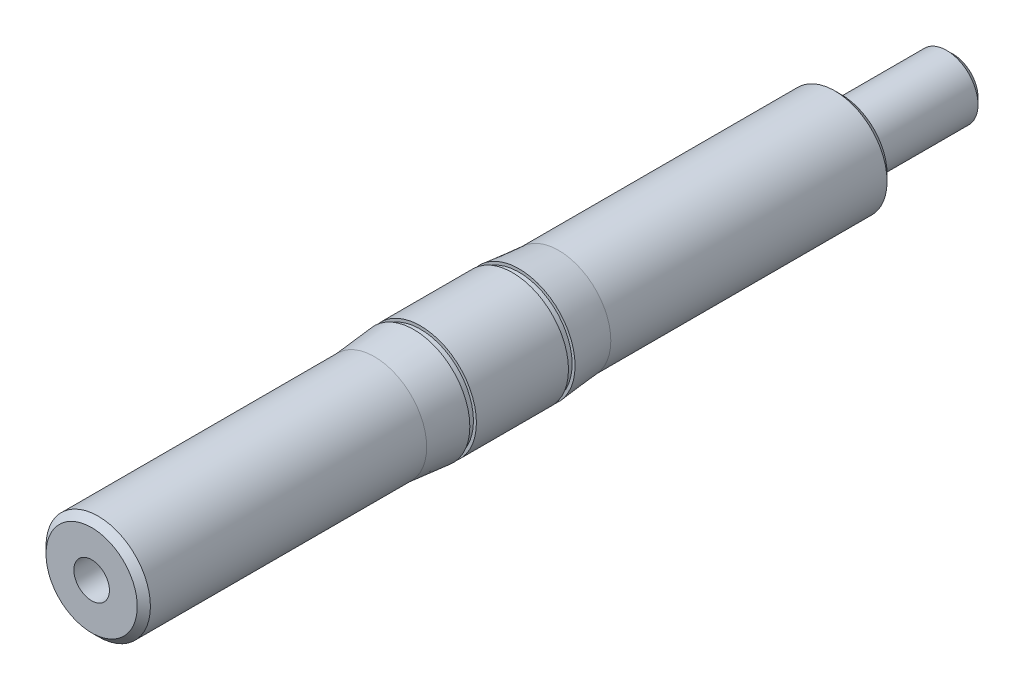
ISO-10303-21;
HEADER;
FILE_DESCRIPTION(('STEP AP214'),'2;1');
FILE_NAME('part.step','',(''),(''),'','','');
FILE_SCHEMA(('AUTOMOTIVE_DESIGN { 1 0 10303 214 1 1 1 1 }'));
ENDSEC;
DATA;
#1=APPLICATION_CONTEXT('core data for automotive mechanical design processes');
#2=APPLICATION_PROTOCOL_DEFINITION('international standard','automotive_design',2000,#1);
#3=PRODUCT_CONTEXT('',#1,'mechanical');
#4=PRODUCT('Part','Part','',(#3));
#5=PRODUCT_RELATED_PRODUCT_CATEGORY('part','',(#4));
#6=PRODUCT_DEFINITION_FORMATION('','',#4);
#7=PRODUCT_DEFINITION_CONTEXT('part definition',#1,'design');
#8=PRODUCT_DEFINITION('design','',#6,#7);
#9=PRODUCT_DEFINITION_SHAPE('','',#8);
#10=(LENGTH_UNIT() NAMED_UNIT(*) SI_UNIT(.MILLI.,.METRE.));
#11=(NAMED_UNIT(*) PLANE_ANGLE_UNIT() SI_UNIT($,.RADIAN.));
#12=(NAMED_UNIT(*) SI_UNIT($,.STERADIAN.) SOLID_ANGLE_UNIT());
#13=UNCERTAINTY_MEASURE_WITH_UNIT(LENGTH_MEASURE(1.E-05),#10,'distance_accuracy_value','');
#14=(GEOMETRIC_REPRESENTATION_CONTEXT(3) GLOBAL_UNCERTAINTY_ASSIGNED_CONTEXT((#13)) GLOBAL_UNIT_ASSIGNED_CONTEXT((#10,
#11,#12)) REPRESENTATION_CONTEXT('',''));
#15=CARTESIAN_POINT('',(0.,0.,0.));
#16=DIRECTION('',(0.,0.,1.));
#17=DIRECTION('',(1.,0.,0.));
#18=AXIS2_PLACEMENT_3D('',#15,#16,#17);
#19=CARTESIAN_POINT('',(0.,0.,83.8048447877854));
#20=DIRECTION('',(0.,0.,1.));
#21=DIRECTION('',(1.,0.,0.));
#22=AXIS2_PLACEMENT_3D('',#19,#20,#21);
#23=CYLINDRICAL_SURFACE('',#22,7.9375);
#24=CARTESIAN_POINT('',(0.,0.,-56.));
#25=DIRECTION('',(0.,0.,1.));
#26=DIRECTION('',(1.,0.,0.));
#27=AXIS2_PLACEMENT_3D('',#24,#25,#26);
#28=CIRCLE('',#27,7.9375);
#29=CARTESIAN_POINT('',(7.9375,0.,-56.));
#30=VERTEX_POINT('',#29);
#31=EDGE_CURVE('E175',#30,#30,#28,.T.);
#32=ORIENTED_EDGE('',*,*,#31,.T.);
#33=EDGE_LOOP('',(#32));
#34=FACE_BOUND('',#33,.T.);
#35=CARTESIAN_POINT('',(0.,0.,-14.));
#36=DIRECTION('',(0.,0.,1.));
#37=DIRECTION('',(1.,0.,0.));
#38=AXIS2_PLACEMENT_3D('',#35,#36,#37);
#39=CIRCLE('',#38,7.9375);
#40=CARTESIAN_POINT('',(7.9375,0.,-14.));
#41=VERTEX_POINT('',#40);
#42=EDGE_CURVE('E135',#41,#41,#39,.T.);
#43=ORIENTED_EDGE('',*,*,#42,.F.);
#44=EDGE_LOOP('',(#43));
#45=FACE_BOUND('',#44,.T.);
#46=ADVANCED_FACE('F112',(#34,#45),#23,.T.);
#47=CARTESIAN_POINT('',(0.,7.9375,-57.));
#48=DIRECTION('',(0.,0.,1.));
#49=DIRECTION('',(1.,0.,0.));
#50=AXIS2_PLACEMENT_3D('',#47,#48,#49);
#51=PLANE('',#50);
#52=CARTESIAN_POINT('',(0.,0.,-57.));
#53=DIRECTION('',(0.,0.,1.));
#54=DIRECTION('',(1.,0.,0.));
#55=AXIS2_PLACEMENT_3D('',#52,#53,#54);
#56=CIRCLE('',#55,4.7625);
#57=CARTESIAN_POINT('',(4.7625,0.,-57.));
#58=VERTEX_POINT('',#57);
#59=EDGE_CURVE('E131',#58,#58,#56,.T.);
#60=ORIENTED_EDGE('',*,*,#59,.T.);
#61=EDGE_LOOP('',(#60));
#62=FACE_BOUND('',#61,.T.);
#63=CARTESIAN_POINT('',(0.,0.,-57.));
#64=DIRECTION('',(0.,0.,1.));
#65=DIRECTION('',(1.,0.,0.));
#66=AXIS2_PLACEMENT_3D('',#63,#64,#65);
#67=CIRCLE('',#66,6.93749999999996);
#68=CARTESIAN_POINT('',(6.93749999999996,0.,-57.));
#69=VERTEX_POINT('',#68);
#70=EDGE_CURVE('E178',#69,#69,#67,.F.);
#71=ORIENTED_EDGE('',*,*,#70,.T.);
#72=EDGE_LOOP('',(#71));
#73=FACE_BOUND('',#72,.T.);
#74=ADVANCED_FACE('F196',(#62,#73),#51,.F.);
#75=CARTESIAN_POINT('',(0.,7.9375,57.));
#76=DIRECTION('',(0.,0.,-1.));
#77=DIRECTION('',(-1.,0.,0.));
#78=AXIS2_PLACEMENT_3D('',#75,#76,#77);
#79=PLANE('',#78);
#80=CARTESIAN_POINT('',(0.,0.,57.));
#81=DIRECTION('',(0.,0.,1.));
#82=DIRECTION('',(1.,0.,0.));
#83=AXIS2_PLACEMENT_3D('',#80,#81,#82);
#84=CIRCLE('',#83,2.7051);
#85=CARTESIAN_POINT('',(2.7051,0.,57.));
#86=VERTEX_POINT('',#85);
#87=EDGE_CURVE('E132',#86,#86,#84,.T.);
#88=ORIENTED_EDGE('',*,*,#87,.F.);
#89=EDGE_LOOP('',(#88));
#90=FACE_BOUND('',#89,.T.);
#91=CARTESIAN_POINT('',(0.,0.,57.));
#92=DIRECTION('',(0.,0.,-1.));
#93=DIRECTION('',(-1.,0.,0.));
#94=AXIS2_PLACEMENT_3D('',#91,#92,#93);
#95=CIRCLE('',#94,6.93750000000001);
#96=CARTESIAN_POINT('',(-6.93750000000001,0.,57.));
#97=VERTEX_POINT('',#96);
#98=EDGE_CURVE('E169',#97,#97,#95,.F.);
#99=ORIENTED_EDGE('',*,*,#98,.T.);
#100=EDGE_LOOP('',(#99));
#101=FACE_BOUND('',#100,.T.);
#102=ADVANCED_FACE('F202',(#90,#101),#79,.F.);
#103=CARTESIAN_POINT('',(0.,0.,83.8048447877854));
#104=DIRECTION('',(0.,0.,1.));
#105=DIRECTION('',(1.,0.,0.));
#106=AXIS2_PLACEMENT_3D('',#103,#104,#105);
#107=CYLINDRICAL_SURFACE('',#106,7.9375);
#108=CARTESIAN_POINT('',(0.,0.,56.));
#109=DIRECTION('',(0.,0.,-1.));
#110=DIRECTION('',(-1.,0.,0.));
#111=AXIS2_PLACEMENT_3D('',#108,#109,#110);
#112=CIRCLE('',#111,7.9375);
#113=CARTESIAN_POINT('',(-7.9375,0.,56.));
#114=VERTEX_POINT('',#113);
#115=EDGE_CURVE('E172',#114,#114,#112,.T.);
#116=ORIENTED_EDGE('',*,*,#115,.T.);
#117=EDGE_LOOP('',(#116));
#118=FACE_BOUND('',#117,.T.);
#119=CARTESIAN_POINT('',(0.,0.,14.));
#120=DIRECTION('',(0.,0.,1.));
#121=DIRECTION('',(1.,0.,0.));
#122=AXIS2_PLACEMENT_3D('',#119,#120,#121);
#123=CIRCLE('',#122,7.9375);
#124=CARTESIAN_POINT('',(7.9375,0.,14.));
#125=VERTEX_POINT('',#124);
#126=EDGE_CURVE('E166',#125,#125,#123,.T.);
#127=ORIENTED_EDGE('',*,*,#126,.T.);
#128=EDGE_LOOP('',(#127));
#129=FACE_BOUND('',#128,.T.);
#130=ADVANCED_FACE('F260',(#118,#129),#107,.T.);
#131=CARTESIAN_POINT('',(0.,0.,8.00000000000001));
#132=DIRECTION('',(0.,0.,-1.));
#133=DIRECTION('',(-1.,0.,0.));
#134=AXIS2_PLACEMENT_3D('',#131,#132,#133);
#135=CONICAL_SURFACE('',#134,8.5,0.0934767811585897);
#136=ORIENTED_EDGE('',*,*,#126,.F.);
#137=EDGE_LOOP('',(#136));
#138=FACE_BOUND('',#137,.T.);
#139=CARTESIAN_POINT('',(0.,0.,8.00000000000001));
#140=DIRECTION('',(0.,0.,1.));
#141=DIRECTION('',(1.,0.,0.));
#142=AXIS2_PLACEMENT_3D('',#139,#140,#141);
#143=CIRCLE('',#142,8.5);
#144=CARTESIAN_POINT('',(8.5,0.,8.00000000000001));
#145=VERTEX_POINT('',#144);
#146=EDGE_CURVE('E163',#145,#145,#143,.T.);
#147=ORIENTED_EDGE('',*,*,#146,.T.);
#148=EDGE_LOOP('',(#147));
#149=FACE_BOUND('',#148,.T.);
#150=ADVANCED_FACE('F256',(#138,#149),#135,.T.);
#151=CARTESIAN_POINT('',(0.,8.05,8.));
#152=DIRECTION('',(0.,0.,1.));
#153=DIRECTION('',(1.,0.,0.));
#154=AXIS2_PLACEMENT_3D('',#151,#152,#153);
#155=PLANE('',#154);
#156=ORIENTED_EDGE('',*,*,#146,.F.);
#157=EDGE_LOOP('',(#156));
#158=FACE_BOUND('',#157,.T.);
#159=CARTESIAN_POINT('',(0.,0.,8.00000000000001));
#160=DIRECTION('',(0.,0.,1.));
#161=DIRECTION('',(1.,0.,0.));
#162=AXIS2_PLACEMENT_3D('',#159,#160,#161);
#163=CIRCLE('',#162,8.05);
#164=CARTESIAN_POINT('',(8.05,0.,8.00000000000001));
#165=VERTEX_POINT('',#164);
#166=EDGE_CURVE('E160',#165,#165,#163,.T.);
#167=ORIENTED_EDGE('',*,*,#166,.T.);
#168=EDGE_LOOP('',(#167));
#169=FACE_BOUND('',#168,.T.);
#170=ADVANCED_FACE('F252',(#158,#169),#155,.F.);
#171=CARTESIAN_POINT('',(0.,0.,83.8048447877854));
#172=DIRECTION('',(0.,0.,1.));
#173=DIRECTION('',(1.,0.,0.));
#174=AXIS2_PLACEMENT_3D('',#171,#172,#173);
#175=CYLINDRICAL_SURFACE('',#174,8.05);
#176=ORIENTED_EDGE('',*,*,#166,.F.);
#177=EDGE_LOOP('',(#176));
#178=FACE_BOUND('',#177,.T.);
#179=CARTESIAN_POINT('',(0.,0.,7.00000000000001));
#180=DIRECTION('',(0.,0.,1.));
#181=DIRECTION('',(1.,0.,0.));
#182=AXIS2_PLACEMENT_3D('',#179,#180,#181);
#183=CIRCLE('',#182,8.05);
#184=CARTESIAN_POINT('',(8.05,0.,7.00000000000001));
#185=VERTEX_POINT('',#184);
#186=EDGE_CURVE('E157',#185,#185,#183,.T.);
#187=ORIENTED_EDGE('',*,*,#186,.T.);
#188=EDGE_LOOP('',(#187));
#189=FACE_BOUND('',#188,.T.);
#190=ADVANCED_FACE('F248',(#178,#189),#175,.T.);
#191=CARTESIAN_POINT('',(0.,8.5,7.));
#192=DIRECTION('',(0.,0.,-1.));
#193=DIRECTION('',(-1.,0.,0.));
#194=AXIS2_PLACEMENT_3D('',#191,#192,#193);
#195=PLANE('',#194);
#196=ORIENTED_EDGE('',*,*,#186,.F.);
#197=EDGE_LOOP('',(#196));
#198=FACE_BOUND('',#197,.T.);
#199=CARTESIAN_POINT('',(0.,0.,7.00000000000001));
#200=DIRECTION('',(0.,0.,1.));
#201=DIRECTION('',(1.,0.,0.));
#202=AXIS2_PLACEMENT_3D('',#199,#200,#201);
#203=CIRCLE('',#202,8.5);
#204=CARTESIAN_POINT('',(8.5,0.,7.00000000000001));
#205=VERTEX_POINT('',#204);
#206=EDGE_CURVE('E154',#205,#205,#203,.T.);
#207=ORIENTED_EDGE('',*,*,#206,.T.);
#208=EDGE_LOOP('',(#207));
#209=FACE_BOUND('',#208,.T.);
#210=ADVANCED_FACE('F244',(#198,#209),#195,.F.);
#211=CARTESIAN_POINT('',(0.,0.,83.8048447877854));
#212=DIRECTION('',(0.,0.,1.));
#213=DIRECTION('',(1.,0.,0.));
#214=AXIS2_PLACEMENT_3D('',#211,#212,#213);
#215=CYLINDRICAL_SURFACE('',#214,8.5);
#216=ORIENTED_EDGE('',*,*,#206,.F.);
#217=EDGE_LOOP('',(#216));
#218=FACE_BOUND('',#217,.T.);
#219=CARTESIAN_POINT('',(0.,0.,-7.00000000000001));
#220=DIRECTION('',(0.,0.,1.));
#221=DIRECTION('',(1.,0.,0.));
#222=AXIS2_PLACEMENT_3D('',#219,#220,#221);
#223=CIRCLE('',#222,8.5);
#224=CARTESIAN_POINT('',(8.5,0.,-7.00000000000001));
#225=VERTEX_POINT('',#224);
#226=EDGE_CURVE('E151',#225,#225,#223,.T.);
#227=ORIENTED_EDGE('',*,*,#226,.T.);
#228=EDGE_LOOP('',(#227));
#229=FACE_BOUND('',#228,.T.);
#230=ADVANCED_FACE('F240',(#218,#229),#215,.T.);
#231=CARTESIAN_POINT('',(0.,8.5,-7.));
#232=DIRECTION('',(0.,0.,1.));
#233=DIRECTION('',(1.,0.,0.));
#234=AXIS2_PLACEMENT_3D('',#231,#232,#233);
#235=PLANE('',#234);
#236=ORIENTED_EDGE('',*,*,#226,.F.);
#237=EDGE_LOOP('',(#236));
#238=FACE_BOUND('',#237,.T.);
#239=CARTESIAN_POINT('',(0.,0.,-7.00000000000001));
#240=DIRECTION('',(0.,0.,1.));
#241=DIRECTION('',(1.,0.,0.));
#242=AXIS2_PLACEMENT_3D('',#239,#240,#241);
#243=CIRCLE('',#242,8.05);
#244=CARTESIAN_POINT('',(8.05,0.,-7.00000000000001));
#245=VERTEX_POINT('',#244);
#246=EDGE_CURVE('E148',#245,#245,#243,.T.);
#247=ORIENTED_EDGE('',*,*,#246,.T.);
#248=EDGE_LOOP('',(#247));
#249=FACE_BOUND('',#248,.T.);
#250=ADVANCED_FACE('F236',(#238,#249),#235,.F.);
#251=CARTESIAN_POINT('',(0.,0.,83.8048447877854));
#252=DIRECTION('',(0.,0.,1.));
#253=DIRECTION('',(1.,0.,0.));
#254=AXIS2_PLACEMENT_3D('',#251,#252,#253);
#255=CYLINDRICAL_SURFACE('',#254,8.05);
#256=ORIENTED_EDGE('',*,*,#246,.F.);
#257=EDGE_LOOP('',(#256));
#258=FACE_BOUND('',#257,.T.);
#259=CARTESIAN_POINT('',(0.,0.,-8.00000000000001));
#260=DIRECTION('',(0.,0.,1.));
#261=DIRECTION('',(1.,0.,0.));
#262=AXIS2_PLACEMENT_3D('',#259,#260,#261);
#263=CIRCLE('',#262,8.05);
#264=CARTESIAN_POINT('',(8.05,0.,-8.00000000000001));
#265=VERTEX_POINT('',#264);
#266=EDGE_CURVE('E145',#265,#265,#263,.T.);
#267=ORIENTED_EDGE('',*,*,#266,.T.);
#268=EDGE_LOOP('',(#267));
#269=FACE_BOUND('',#268,.T.);
#270=ADVANCED_FACE('F232',(#258,#269),#255,.T.);
#271=CARTESIAN_POINT('',(0.,8.05,-8.));
#272=DIRECTION('',(0.,0.,-1.));
#273=DIRECTION('',(-1.,0.,0.));
#274=AXIS2_PLACEMENT_3D('',#271,#272,#273);
#275=PLANE('',#274);
#276=ORIENTED_EDGE('',*,*,#266,.F.);
#277=EDGE_LOOP('',(#276));
#278=FACE_BOUND('',#277,.T.);
#279=CARTESIAN_POINT('',(0.,0.,-8.00000000000001));
#280=DIRECTION('',(0.,0.,1.));
#281=DIRECTION('',(1.,0.,0.));
#282=AXIS2_PLACEMENT_3D('',#279,#280,#281);
#283=CIRCLE('',#282,8.5);
#284=CARTESIAN_POINT('',(8.5,0.,-8.00000000000001));
#285=VERTEX_POINT('',#284);
#286=EDGE_CURVE('E142',#285,#285,#283,.T.);
#287=ORIENTED_EDGE('',*,*,#286,.T.);
#288=EDGE_LOOP('',(#287));
#289=FACE_BOUND('',#288,.T.);
#290=ADVANCED_FACE('F228',(#278,#289),#275,.F.);
#291=CARTESIAN_POINT('',(0.,0.,-14.));
#292=DIRECTION('',(0.,0.,1.));
#293=DIRECTION('',(1.,0.,0.));
#294=AXIS2_PLACEMENT_3D('',#291,#292,#293);
#295=CONICAL_SURFACE('',#294,7.9375,0.0934767811585897);
#296=ORIENTED_EDGE('',*,*,#286,.F.);
#297=EDGE_LOOP('',(#296));
#298=FACE_BOUND('',#297,.T.);
#299=ORIENTED_EDGE('',*,*,#42,.T.);
#300=EDGE_LOOP('',(#299));
#301=FACE_BOUND('',#300,.T.);
#302=ADVANCED_FACE('F211',(#298,#301),#295,.T.);
#303=CARTESIAN_POINT('',(0.,0.,57.));
#304=DIRECTION('',(0.,0.,-1.));
#305=DIRECTION('',(-1.,0.,0.));
#306=AXIS2_PLACEMENT_3D('',#303,#304,#305);
#307=CONICAL_SURFACE('',#306,6.93750000000001,0.785398163397445);
#308=ORIENTED_EDGE('',*,*,#115,.F.);
#309=EDGE_LOOP('',(#308));
#310=FACE_BOUND('',#309,.T.);
#311=ORIENTED_EDGE('',*,*,#98,.F.);
#312=EDGE_LOOP('',(#311));
#313=FACE_BOUND('',#312,.T.);
#314=ADVANCED_FACE('F208',(#310,#313),#307,.T.);
#315=CARTESIAN_POINT('',(0.,0.,-56.));
#316=DIRECTION('',(0.,0.,1.));
#317=DIRECTION('',(1.,0.,0.));
#318=AXIS2_PLACEMENT_3D('',#315,#316,#317);
#319=CONICAL_SURFACE('',#318,7.9375,0.785398163397462);
#320=ORIENTED_EDGE('',*,*,#70,.F.);
#321=EDGE_LOOP('',(#320));
#322=FACE_BOUND('',#321,.T.);
#323=ORIENTED_EDGE('',*,*,#31,.F.);
#324=EDGE_LOOP('',(#323));
#325=FACE_BOUND('',#324,.T.);
#326=ADVANCED_FACE('F210',(#322,#325),#319,.T.);
#327=CARTESIAN_POINT('',(0.,0.,-74.));
#328=DIRECTION('',(0.,0.,1.));
#329=DIRECTION('',(1.,0.,0.));
#330=AXIS2_PLACEMENT_3D('',#327,#328,#329);
#331=CYLINDRICAL_SURFACE('',#330,4.7625);
#332=CARTESIAN_POINT('',(0.,0.,-73.));
#333=DIRECTION('',(0.,0.,1.));
#334=DIRECTION('',(1.,0.,0.));
#335=AXIS2_PLACEMENT_3D('',#332,#333,#334);
#336=CIRCLE('',#335,4.7625);
#337=CARTESIAN_POINT('',(4.7625,0.,-73.));
#338=VERTEX_POINT('',#337);
#339=EDGE_CURVE('E119',#338,#338,#336,.T.);
#340=ORIENTED_EDGE('',*,*,#339,.T.);
#341=EDGE_LOOP('',(#340));
#342=FACE_BOUND('',#341,.T.);
#343=ORIENTED_EDGE('',*,*,#59,.F.);
#344=EDGE_LOOP('',(#343));
#345=FACE_BOUND('',#344,.T.);
#346=ADVANCED_FACE('F183',(#342,#345),#331,.T.);
#347=CARTESIAN_POINT('',(0.,0.,-74.));
#348=DIRECTION('',(0.,0.,1.));
#349=DIRECTION('',(1.,0.,0.));
#350=AXIS2_PLACEMENT_3D('',#347,#348,#349);
#351=PLANE('',#350);
#352=CARTESIAN_POINT('',(0.,0.,-74.));
#353=DIRECTION('',(0.,0.,1.));
#354=DIRECTION('',(1.,0.,0.));
#355=AXIS2_PLACEMENT_3D('',#352,#353,#354);
#356=CIRCLE('',#355,3.7625);
#357=CARTESIAN_POINT('',(3.7625,0.,-74.));
#358=VERTEX_POINT('',#357);
#359=EDGE_CURVE('E12',#358,#358,#356,.F.);
#360=ORIENTED_EDGE('',*,*,#359,.T.);
#361=EDGE_LOOP('',(#360));
#362=FACE_BOUND('',#361,.T.);
#363=ADVANCED_FACE('F187',(#362),#351,.F.);
#364=CARTESIAN_POINT('',(0.,0.,-73.));
#365=DIRECTION('',(0.,0.,1.));
#366=DIRECTION('',(1.,0.,0.));
#367=AXIS2_PLACEMENT_3D('',#364,#365,#366);
#368=CONICAL_SURFACE('',#367,4.7625,0.78539816339744);
#369=ORIENTED_EDGE('',*,*,#359,.F.);
#370=EDGE_LOOP('',(#369));
#371=FACE_BOUND('',#370,.T.);
#372=ORIENTED_EDGE('',*,*,#339,.F.);
#373=EDGE_LOOP('',(#372));
#374=FACE_BOUND('',#373,.T.);
#375=ADVANCED_FACE('F114',(#371,#374),#368,.T.);
#376=CARTESIAN_POINT('',(0.,0.,41.58));
#377=DIRECTION('',(0.,0.,1.));
#378=DIRECTION('',(1.,0.,0.));
#379=AXIS2_PLACEMENT_3D('',#376,#377,#378);
#380=CONICAL_SURFACE('',#379,2.7051,1.02974425867665);
#381=CARTESIAN_POINT('',(0.,0.,39.9546119394685));
#382=VERTEX_POINT('',#381);
#383=VERTEX_LOOP('',#382);
#384=FACE_BOUND('',#383,.T.);
#385=CARTESIAN_POINT('',(0.,0.,41.58));
#386=DIRECTION('',(0.,0.,1.));
#387=DIRECTION('',(1.,0.,0.));
#388=AXIS2_PLACEMENT_3D('',#385,#386,#387);
#389=CIRCLE('',#388,2.7051);
#390=CARTESIAN_POINT('',(2.7051,0.,41.58));
#391=VERTEX_POINT('',#390);
#392=EDGE_CURVE('E129',#391,#391,#389,.T.);
#393=ORIENTED_EDGE('',*,*,#392,.T.);
#394=EDGE_LOOP('',(#393));
#395=FACE_BOUND('',#394,.T.);
#396=ADVANCED_FACE('F122',(#384,#395),#380,.F.);
#397=CARTESIAN_POINT('',(0.,0.,57.));
#398=DIRECTION('',(0.,0.,1.));
#399=DIRECTION('',(1.,0.,0.));
#400=AXIS2_PLACEMENT_3D('',#397,#398,#399);
#401=CYLINDRICAL_SURFACE('',#400,2.7051);
#402=ORIENTED_EDGE('',*,*,#392,.F.);
#403=EDGE_LOOP('',(#402));
#404=FACE_BOUND('',#403,.T.);
#405=ORIENTED_EDGE('',*,*,#87,.T.);
#406=EDGE_LOOP('',(#405));
#407=FACE_BOUND('',#406,.T.);
#408=ADVANCED_FACE('F125',(#404,#407),#401,.F.);
#409=CLOSED_SHELL('',(#46,#74,#102,#130,#150,#170,#190,#210,#230,#250,#270,#290,#302,#314,#326,
#346,#363,#375,#396,#408));
#410=MANIFOLD_SOLID_BREP('B2',#409);
#411=ADVANCED_BREP_SHAPE_REPRESENTATION('',(#18,#410),#14);
#412=SHAPE_DEFINITION_REPRESENTATION(#9,#411);
ENDSEC;
END-ISO-10303-21;
